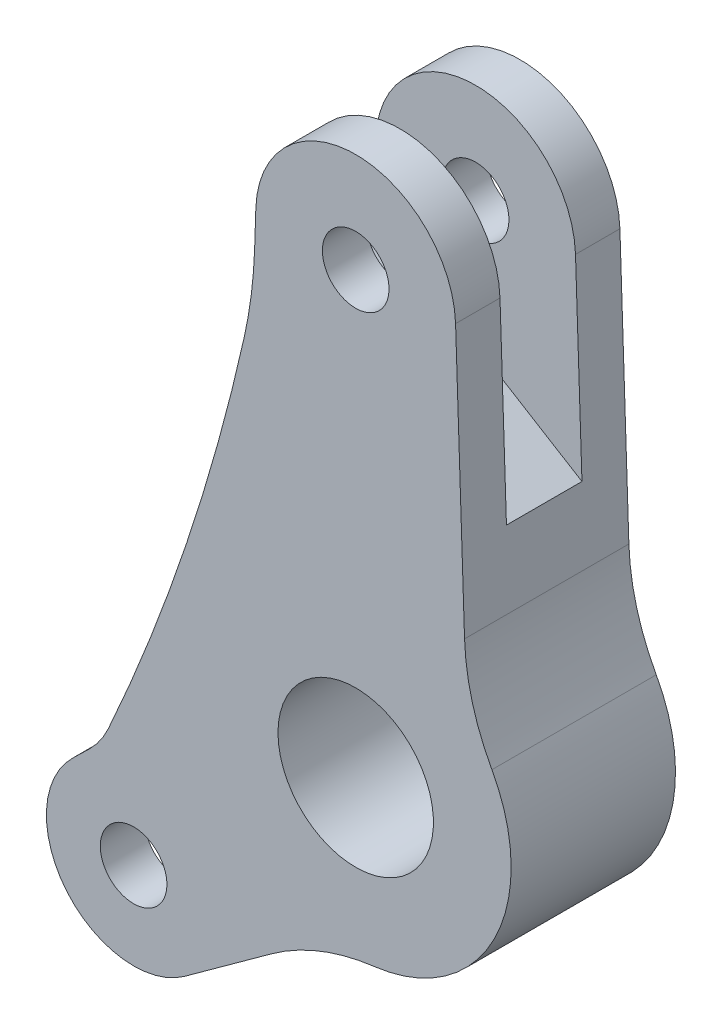
ISO-10303-21;
HEADER;
FILE_DESCRIPTION(('STEP AP214'),'2;1');
FILE_NAME('part.step','',(''),(''),'','','');
FILE_SCHEMA(('AUTOMOTIVE_DESIGN { 1 0 10303 214 1 1 1 1 }'));
ENDSEC;
DATA;
#1=APPLICATION_CONTEXT('core data for automotive mechanical design processes');
#2=APPLICATION_PROTOCOL_DEFINITION('international standard','automotive_design',2000,#1);
#3=PRODUCT_CONTEXT('',#1,'mechanical');
#4=PRODUCT('Part','Part','',(#3));
#5=PRODUCT_RELATED_PRODUCT_CATEGORY('part','',(#4));
#6=PRODUCT_DEFINITION_FORMATION('','',#4);
#7=PRODUCT_DEFINITION_CONTEXT('part definition',#1,'design');
#8=PRODUCT_DEFINITION('design','',#6,#7);
#9=PRODUCT_DEFINITION_SHAPE('','',#8);
#10=(LENGTH_UNIT() NAMED_UNIT(*) SI_UNIT(.MILLI.,.METRE.));
#11=(NAMED_UNIT(*) PLANE_ANGLE_UNIT() SI_UNIT($,.RADIAN.));
#12=(NAMED_UNIT(*) SI_UNIT($,.STERADIAN.) SOLID_ANGLE_UNIT());
#13=UNCERTAINTY_MEASURE_WITH_UNIT(LENGTH_MEASURE(1.E-05),#10,'distance_accuracy_value','');
#14=(GEOMETRIC_REPRESENTATION_CONTEXT(3) GLOBAL_UNCERTAINTY_ASSIGNED_CONTEXT((#13)) GLOBAL_UNIT_ASSIGNED_CONTEXT((#10,
#11,#12)) REPRESENTATION_CONTEXT('',''));
#15=CARTESIAN_POINT('',(0.,0.,0.));
#16=DIRECTION('',(0.,0.,1.));
#17=DIRECTION('',(1.,0.,0.));
#18=AXIS2_PLACEMENT_3D('',#15,#16,#17);
#19=CARTESIAN_POINT('',(-1.89883544819038,-4.38734354159406,1.85));
#20=DIRECTION('',(-0.586558009835035,0.809907217586288,0.));
#21=DIRECTION('',(0.809907217586288,0.586558009835035,0.));
#22=AXIS2_PLACEMENT_3D('',#19,#20,#21);
#23=PLANE('',#22);
#24=DIRECTION('',(-0.809907217586288,-0.586558009835035,0.));
#25=VECTOR('',#24,1.);
#26=CARTESIAN_POINT('',(-1.89883544819038,-4.38734354159406,-0.85));
#27=LINE('',#26,#25);
#28=CARTESIAN_POINT('',(-2.35712113183313,-4.7192471630169,-0.85));
#29=VERTEX_POINT('',#28);
#30=CARTESIAN_POINT('',(-3.84954684208149,-5.80010461856446,-0.85));
#31=VERTEX_POINT('',#30);
#32=EDGE_CURVE('E199',#29,#31,#27,.T.);
#33=ORIENTED_EDGE('',*,*,#32,.T.);
#34=DIRECTION('',(0.,0.,-1.));
#35=VECTOR('',#34,1.);
#36=CARTESIAN_POINT('',(-3.84954684208149,-5.80010461856446,1.85));
#37=LINE('',#36,#35);
#38=CARTESIAN_POINT('',(-3.84954684208149,-5.80010461856446,-1.85));
#39=VERTEX_POINT('',#38);
#40=EDGE_CURVE('E374',#31,#39,#37,.T.);
#41=ORIENTED_EDGE('',*,*,#40,.T.);
#42=DIRECTION('',(-0.809907217586288,-0.586558009835035,0.));
#43=VECTOR('',#42,1.);
#44=CARTESIAN_POINT('',(-1.89883544819038,-4.38734354159406,-1.85));
#45=LINE('',#44,#43);
#46=CARTESIAN_POINT('',(-1.89883544819038,-4.38734354159406,-1.85));
#47=VERTEX_POINT('',#46);
#48=EDGE_CURVE('E310',#47,#39,#45,.T.);
#49=ORIENTED_EDGE('',*,*,#48,.F.);
#50=DIRECTION('',(0.,0.,-1.));
#51=VECTOR('',#50,1.);
#52=CARTESIAN_POINT('',(-1.89883544819038,-4.38734354159406,1.85));
#53=LINE('',#52,#51);
#54=CARTESIAN_POINT('',(-1.89883544819038,-4.38734354159406,1.85));
#55=VERTEX_POINT('',#54);
#56=EDGE_CURVE('E11',#55,#47,#53,.T.);
#57=ORIENTED_EDGE('',*,*,#56,.F.);
#58=DIRECTION('',(-0.809907217586288,-0.586558009835035,0.));
#59=VECTOR('',#58,1.);
#60=CARTESIAN_POINT('',(-1.89883544819038,-4.38734354159406,1.85));
#61=LINE('',#60,#59);
#62=CARTESIAN_POINT('',(-3.84954684208149,-5.80010461856446,1.85));
#63=VERTEX_POINT('',#62);
#64=EDGE_CURVE('E276',#55,#63,#61,.T.);
#65=ORIENTED_EDGE('',*,*,#64,.T.);
#66=CARTESIAN_POINT('',(-3.84954684208149,-5.80010461856446,0.85));
#67=VERTEX_POINT('',#66);
#68=EDGE_CURVE('E44',#63,#67,#37,.T.);
#69=ORIENTED_EDGE('',*,*,#68,.T.);
#70=DIRECTION('',(-0.809907217586288,-0.586558009835035,0.));
#71=VECTOR('',#70,1.);
#72=CARTESIAN_POINT('',(-1.89883544819038,-4.38734354159406,0.85));
#73=LINE('',#72,#71);
#74=CARTESIAN_POINT('',(-2.35712113183313,-4.7192471630169,0.85));
#75=VERTEX_POINT('',#74);
#76=EDGE_CURVE('E219',#75,#67,#73,.T.);
#77=ORIENTED_EDGE('',*,*,#76,.F.);
#78=DIRECTION('',(0.,0.,1.));
#79=VECTOR('',#78,1.);
#80=CARTESIAN_POINT('',(-2.35712113183313,-4.7192471630169,1.85));
#81=LINE('',#80,#79);
#82=EDGE_CURVE('E253',#29,#75,#81,.T.);
#83=ORIENTED_EDGE('',*,*,#82,.F.);
#84=EDGE_LOOP('',(#33,#41,#49,#57,#65,#69,#77,#83));
#85=FACE_BOUND('',#84,.T.);
#86=ADVANCED_FACE('F35',(#85),#23,.F.);
#87=CARTESIAN_POINT('',(-5.00079103651948,-4.21049034913888,1.85));
#88=DIRECTION('',(0.,0.,-1.));
#89=DIRECTION('',(1.,0.,0.));
#90=AXIS2_PLACEMENT_3D('',#87,#88,#89);
#91=CYLINDRICAL_SURFACE('',#90,1.96271157350961);
#92=CARTESIAN_POINT('',(-5.00079103651948,-4.21049034913888,-0.85));
#93=DIRECTION('',(0.,0.,-1.));
#94=DIRECTION('',(-1.,0.,0.));
#95=AXIS2_PLACEMENT_3D('',#92,#93,#94);
#96=CIRCLE('',#95,1.96271157350961);
#97=CARTESIAN_POINT('',(-6.37107044623599,-2.80529603513973,-0.85));
#98=VERTEX_POINT('',#97);
#99=EDGE_CURVE('E226',#31,#98,#96,.T.);
#100=ORIENTED_EDGE('',*,*,#99,.T.);
#101=DIRECTION('',(0.,0.,-1.));
#102=VECTOR('',#101,1.);
#103=CARTESIAN_POINT('',(-6.37107044623599,-2.80529603513973,1.85));
#104=LINE('',#103,#102);
#105=CARTESIAN_POINT('',(-6.37107044623599,-2.80529603513973,-1.85));
#106=VERTEX_POINT('',#105);
#107=EDGE_CURVE('E370',#98,#106,#104,.T.);
#108=ORIENTED_EDGE('',*,*,#107,.T.);
#109=CARTESIAN_POINT('',(-5.00079103651948,-4.21049034913888,-1.85));
#110=DIRECTION('',(0.,0.,-1.));
#111=DIRECTION('',(-1.,0.,0.));
#112=AXIS2_PLACEMENT_3D('',#109,#110,#111);
#113=CIRCLE('',#112,1.96271157350961);
#114=EDGE_CURVE('E313',#39,#106,#113,.T.);
#115=ORIENTED_EDGE('',*,*,#114,.F.);
#116=ORIENTED_EDGE('',*,*,#40,.F.);
#117=EDGE_LOOP('',(#100,#108,#115,#116));
#118=FACE_BOUND('',#117,.T.);
#119=ADVANCED_FACE('F462',(#118),#91,.T.);
#120=CARTESIAN_POINT('',(-5.99474337438653,-2.43831957306836,1.85));
#121=DIRECTION('',(0.698156279410047,-0.715945395627572,0.));
#122=DIRECTION('',(-0.715945395627572,-0.698156279410047,0.));
#123=AXIS2_PLACEMENT_3D('',#120,#121,#122);
#124=PLANE('',#123);
#125=DIRECTION('',(0.715945395627572,0.698156279410047,0.));
#126=VECTOR('',#125,1.);
#127=CARTESIAN_POINT('',(-5.99474337438653,-2.43831957306836,-0.85));
#128=LINE('',#127,#126);
#129=CARTESIAN_POINT('',(-5.99474337438653,-2.43831957306836,-0.85));
#130=VERTEX_POINT('',#129);
#131=EDGE_CURVE('E216',#98,#130,#128,.T.);
#132=ORIENTED_EDGE('',*,*,#131,.T.);
#133=DIRECTION('',(0.,0.,-1.));
#134=VECTOR('',#133,1.);
#135=CARTESIAN_POINT('',(-5.99474337438653,-2.43831957306836,1.85));
#136=LINE('',#135,#134);
#137=CARTESIAN_POINT('',(-5.99474337438653,-2.43831957306836,-1.85));
#138=VERTEX_POINT('',#137);
#139=EDGE_CURVE('E366',#130,#138,#136,.T.);
#140=ORIENTED_EDGE('',*,*,#139,.T.);
#141=DIRECTION('',(0.715945395627572,0.698156279410047,0.));
#142=VECTOR('',#141,1.);
#143=CARTESIAN_POINT('',(-5.99474337438653,-2.43831957306836,-1.85));
#144=LINE('',#143,#142);
#145=EDGE_CURVE('E316',#106,#138,#144,.T.);
#146=ORIENTED_EDGE('',*,*,#145,.F.);
#147=ORIENTED_EDGE('',*,*,#107,.F.);
#148=EDGE_LOOP('',(#132,#140,#146,#147));
#149=FACE_BOUND('',#148,.T.);
#150=ADVANCED_FACE('F460',(#149),#124,.F.);
#151=CARTESIAN_POINT('',(-7.39105593320663,-1.00642878181321,1.85));
#152=DIRECTION('',(0.,0.,-1.));
#153=DIRECTION('',(1.,0.,0.));
#154=AXIS2_PLACEMENT_3D('',#151,#152,#153);
#155=CYLINDRICAL_SURFACE('',#154,2.);
#156=CARTESIAN_POINT('',(-7.39105593320663,-1.00642878181321,-0.85));
#157=DIRECTION('',(0.,0.,-1.));
#158=DIRECTION('',(-1.,0.,0.));
#159=AXIS2_PLACEMENT_3D('',#156,#157,#158);
#160=CIRCLE('',#159,2.);
#161=CARTESIAN_POINT('',(-5.56845578497481,-1.82991448276097,-0.85));
#162=VERTEX_POINT('',#161);
#163=EDGE_CURVE('E213',#130,#162,#160,.F.);
#164=ORIENTED_EDGE('',*,*,#163,.T.);
#165=DIRECTION('',(0.,0.,-1.));
#166=VECTOR('',#165,1.);
#167=CARTESIAN_POINT('',(-5.56845578497481,-1.82991448276097,1.85));
#168=LINE('',#167,#166);
#169=CARTESIAN_POINT('',(-5.56845578497481,-1.82991448276097,-1.85));
#170=VERTEX_POINT('',#169);
#171=EDGE_CURVE('E211',#162,#170,#168,.T.);
#172=ORIENTED_EDGE('',*,*,#171,.T.);
#173=CARTESIAN_POINT('',(-7.39105593320663,-1.00642878181321,-1.85));
#174=DIRECTION('',(0.,0.,1.));
#175=DIRECTION('',(-1.,0.,0.));
#176=AXIS2_PLACEMENT_3D('',#173,#174,#175);
#177=CIRCLE('',#176,2.);
#178=EDGE_CURVE('E319',#138,#170,#177,.T.);
#179=ORIENTED_EDGE('',*,*,#178,.F.);
#180=ORIENTED_EDGE('',*,*,#139,.F.);
#181=EDGE_LOOP('',(#164,#172,#179,#180));
#182=FACE_BOUND('',#181,.T.);
#183=ADVANCED_FACE('F455',(#182),#155,.F.);
#184=CARTESIAN_POINT('',(-48.7361620669657,17.67408308929,1.85));
#185=DIRECTION('',(0.,0.,-1.));
#186=DIRECTION('',(1.,0.,0.));
#187=AXIS2_PLACEMENT_3D('',#184,#185,#186);
#188=CYLINDRICAL_SURFACE('',#187,47.3693654901436);
#189=CARTESIAN_POINT('',(-48.7361620669657,17.67408308929,-0.85));
#190=DIRECTION('',(0.,0.,-1.));
#191=DIRECTION('',(-1.,0.,0.));
#192=AXIS2_PLACEMENT_3D('',#189,#190,#191);
#193=CIRCLE('',#192,47.3693654901436);
#194=CARTESIAN_POINT('',(-4.17602011367658,1.60390773114507,-0.85));
#195=VERTEX_POINT('',#194);
#196=EDGE_CURVE('E196',#162,#195,#193,.F.);
#197=ORIENTED_EDGE('',*,*,#196,.T.);
#198=DIRECTION('',(0.,0.,1.));
#199=VECTOR('',#198,1.);
#200=CARTESIAN_POINT('',(-4.17602011367658,1.60390773114507,-0.85));
#201=LINE('',#200,#199);
#202=CARTESIAN_POINT('',(-4.17602011367658,1.60390773114507,0.85));
#203=VERTEX_POINT('',#202);
#204=EDGE_CURVE('E201',#195,#203,#201,.T.);
#205=ORIENTED_EDGE('',*,*,#204,.T.);
#206=CARTESIAN_POINT('',(-48.7361620669657,17.67408308929,0.85));
#207=DIRECTION('',(0.,0.,-1.));
#208=DIRECTION('',(-1.,0.,0.));
#209=AXIS2_PLACEMENT_3D('',#206,#207,#208);
#210=CIRCLE('',#209,47.3693654901436);
#211=CARTESIAN_POINT('',(-5.56845578497481,-1.82991448276097,0.85));
#212=VERTEX_POINT('',#211);
#213=EDGE_CURVE('E378',#212,#203,#210,.F.);
#214=ORIENTED_EDGE('',*,*,#213,.F.);
#215=CARTESIAN_POINT('',(-5.56845578497481,-1.82991448276097,1.85));
#216=VERTEX_POINT('',#215);
#217=EDGE_CURVE('E363',#216,#212,#168,.T.);
#218=ORIENTED_EDGE('',*,*,#217,.F.);
#219=CARTESIAN_POINT('',(-48.7361620669657,17.67408308929,1.85));
#220=DIRECTION('',(0.,0.,1.));
#221=DIRECTION('',(-1.,0.,0.));
#222=AXIS2_PLACEMENT_3D('',#219,#220,#221);
#223=CIRCLE('',#222,47.3693654901436);
#224=CARTESIAN_POINT('',(-2.51157735789529,7.32301766524892,1.85));
#225=VERTEX_POINT('',#224);
#226=EDGE_CURVE('E288',#216,#225,#223,.T.);
#227=ORIENTED_EDGE('',*,*,#226,.T.);
#228=DIRECTION('',(0.,0.,-1.));
#229=VECTOR('',#228,1.);
#230=CARTESIAN_POINT('',(-2.51157735789529,7.32301766524892,1.85));
#231=LINE('',#230,#229);
#232=CARTESIAN_POINT('',(-2.51157735789529,7.32301766524892,-1.85));
#233=VERTEX_POINT('',#232);
#234=EDGE_CURVE('E360',#225,#233,#231,.T.);
#235=ORIENTED_EDGE('',*,*,#234,.T.);
#236=CARTESIAN_POINT('',(-48.7361620669657,17.67408308929,-1.85));
#237=DIRECTION('',(0.,0.,1.));
#238=DIRECTION('',(-1.,0.,0.));
#239=AXIS2_PLACEMENT_3D('',#236,#237,#238);
#240=CIRCLE('',#239,47.3693654901436);
#241=EDGE_CURVE('E322',#170,#233,#240,.T.);
#242=ORIENTED_EDGE('',*,*,#241,.F.);
#243=ORIENTED_EDGE('',*,*,#171,.F.);
#244=EDGE_LOOP('',(#197,#205,#214,#218,#227,#235,#242,#243));
#245=FACE_BOUND('',#244,.T.);
#246=ADVANCED_FACE('F209',(#245),#188,.F.);
#247=CARTESIAN_POINT('',(-12.2699062336934,9.50819901968249,1.85));
#248=DIRECTION('',(0.,0.,-1.));
#249=DIRECTION('',(1.,0.,0.));
#250=AXIS2_PLACEMENT_3D('',#247,#248,#249);
#251=CYLINDRICAL_SURFACE('',#250,10.);
#252=CARTESIAN_POINT('',(-12.2699062336934,9.50819901968249,-0.85));
#253=DIRECTION('',(0.,0.,-1.));
#254=DIRECTION('',(-1.,0.,0.));
#255=AXIS2_PLACEMENT_3D('',#252,#253,#254);
#256=CIRCLE('',#255,10.);
#257=CARTESIAN_POINT('',(-2.32019862464675,8.50654114671467,-0.85));
#258=VERTEX_POINT('',#257);
#259=CARTESIAN_POINT('',(-2.27547486616742,9.17452007247119,-0.85));
#260=VERTEX_POINT('',#259);
#261=EDGE_CURVE('E250',#258,#260,#256,.F.);
#262=ORIENTED_EDGE('',*,*,#261,.T.);
#263=DIRECTION('',(0.,0.,-1.));
#264=VECTOR('',#263,1.);
#265=CARTESIAN_POINT('',(-2.27547486616742,9.17452007247119,1.85));
#266=LINE('',#265,#264);
#267=CARTESIAN_POINT('',(-2.27547486616742,9.17452007247119,-1.85));
#268=VERTEX_POINT('',#267);
#269=EDGE_CURVE('E356',#260,#268,#266,.T.);
#270=ORIENTED_EDGE('',*,*,#269,.T.);
#271=CARTESIAN_POINT('',(-12.2699062336934,9.50819901968249,-1.85));
#272=DIRECTION('',(0.,0.,1.));
#273=DIRECTION('',(1.,0.,0.));
#274=AXIS2_PLACEMENT_3D('',#271,#272,#273);
#275=CIRCLE('',#274,10.);
#276=EDGE_CURVE('E325',#233,#268,#275,.T.);
#277=ORIENTED_EDGE('',*,*,#276,.F.);
#278=ORIENTED_EDGE('',*,*,#234,.F.);
#279=CARTESIAN_POINT('',(-12.2699062336934,9.50819901968249,1.85));
#280=DIRECTION('',(0.,0.,1.));
#281=DIRECTION('',(1.,0.,0.));
#282=AXIS2_PLACEMENT_3D('',#279,#280,#281);
#283=CIRCLE('',#282,10.);
#284=CARTESIAN_POINT('',(-2.27547486616742,9.17452007247119,1.85));
#285=VERTEX_POINT('',#284);
#286=EDGE_CURVE('E291',#225,#285,#283,.T.);
#287=ORIENTED_EDGE('',*,*,#286,.T.);
#288=CARTESIAN_POINT('',(-2.27547486616742,9.17452007247119,0.85));
#289=VERTEX_POINT('',#288);
#290=EDGE_CURVE('E357',#285,#289,#266,.T.);
#291=ORIENTED_EDGE('',*,*,#290,.T.);
#292=CARTESIAN_POINT('',(-12.2699062336934,9.50819901968249,0.85));
#293=DIRECTION('',(0.,0.,-1.));
#294=DIRECTION('',(-1.,0.,0.));
#295=AXIS2_PLACEMENT_3D('',#292,#293,#294);
#296=CIRCLE('',#295,10.);
#297=CARTESIAN_POINT('',(-2.32019862464675,8.50654114671467,0.85));
#298=VERTEX_POINT('',#297);
#299=EDGE_CURVE('E238',#298,#289,#296,.F.);
#300=ORIENTED_EDGE('',*,*,#299,.F.);
#301=DIRECTION('',(0.,0.,1.));
#302=VECTOR('',#301,1.);
#303=CARTESIAN_POINT('',(-2.32019862464675,8.50654114671467,-0.85));
#304=LINE('',#303,#302);
#305=EDGE_CURVE('E397',#258,#298,#304,.T.);
#306=ORIENTED_EDGE('',*,*,#305,.F.);
#307=EDGE_LOOP('',(#262,#270,#277,#278,#287,#291,#300,#306));
#308=FACE_BOUND('',#307,.T.);
#309=ADVANCED_FACE('F402',(#308),#251,.F.);
#310=CARTESIAN_POINT('',(-2.24874705769335,9.97507776312254,1.85));
#311=DIRECTION('',(0.999443136752602,-0.033367894721129,0.));
#312=DIRECTION('',(-0.033367894721129,-0.999443136752602,0.));
#313=AXIS2_PLACEMENT_3D('',#310,#311,#312);
#314=PLANE('',#313);
#315=DIRECTION('',(0.033367894721129,0.999443136752602,0.));
#316=VECTOR('',#315,1.);
#317=CARTESIAN_POINT('',(-2.24874705769335,9.97507776312254,-0.85));
#318=LINE('',#317,#316);
#319=CARTESIAN_POINT('',(-2.24874705769335,9.97507776312254,-0.85));
#320=VERTEX_POINT('',#319);
#321=EDGE_CURVE('E247',#260,#320,#318,.T.);
#322=ORIENTED_EDGE('',*,*,#321,.T.);
#323=DIRECTION('',(0.,0.,-1.));
#324=VECTOR('',#323,1.);
#325=CARTESIAN_POINT('',(-2.24874705769335,9.97507776312254,1.85));
#326=LINE('',#325,#324);
#327=CARTESIAN_POINT('',(-2.24874705769335,9.97507776312254,-1.85));
#328=VERTEX_POINT('',#327);
#329=EDGE_CURVE('E352',#320,#328,#326,.T.);
#330=ORIENTED_EDGE('',*,*,#329,.T.);
#331=DIRECTION('',(0.033367894721129,0.999443136752602,0.));
#332=VECTOR('',#331,1.);
#333=CARTESIAN_POINT('',(-2.24874705769335,9.97507776312254,-1.85));
#334=LINE('',#333,#332);
#335=EDGE_CURVE('E328',#268,#328,#334,.T.);
#336=ORIENTED_EDGE('',*,*,#335,.F.);
#337=ORIENTED_EDGE('',*,*,#269,.F.);
#338=EDGE_LOOP('',(#322,#330,#336,#337));
#339=FACE_BOUND('',#338,.T.);
#340=ADVANCED_FACE('F481',(#339),#314,.F.);
#341=CARTESIAN_POINT('',(0.,9.9,1.85));
#342=DIRECTION('',(0.,0.,-1.));
#343=DIRECTION('',(1.,0.,0.));
#344=AXIS2_PLACEMENT_3D('',#341,#342,#343);
#345=CYLINDRICAL_SURFACE('',#344,2.25);
#346=CARTESIAN_POINT('',(0.,9.9,-0.85));
#347=DIRECTION('',(0.,0.,-1.));
#348=DIRECTION('',(-1.,0.,0.));
#349=AXIS2_PLACEMENT_3D('',#346,#347,#348);
#350=CIRCLE('',#349,2.25);
#351=CARTESIAN_POINT('',(2.24874705769335,9.97507776312254,-0.85));
#352=VERTEX_POINT('',#351);
#353=EDGE_CURVE('E244',#320,#352,#350,.T.);
#354=ORIENTED_EDGE('',*,*,#353,.T.);
#355=DIRECTION('',(0.,0.,-1.));
#356=VECTOR('',#355,1.);
#357=CARTESIAN_POINT('',(2.24874705769335,9.97507776312254,1.85));
#358=LINE('',#357,#356);
#359=CARTESIAN_POINT('',(2.24874705769335,9.97507776312254,-1.85));
#360=VERTEX_POINT('',#359);
#361=EDGE_CURVE('E348',#352,#360,#358,.T.);
#362=ORIENTED_EDGE('',*,*,#361,.T.);
#363=CARTESIAN_POINT('',(0.,9.9,-1.85));
#364=DIRECTION('',(0.,0.,-1.));
#365=DIRECTION('',(1.,0.,0.));
#366=AXIS2_PLACEMENT_3D('',#363,#364,#365);
#367=CIRCLE('',#366,2.25);
#368=EDGE_CURVE('E331',#328,#360,#367,.T.);
#369=ORIENTED_EDGE('',*,*,#368,.F.);
#370=ORIENTED_EDGE('',*,*,#329,.F.);
#371=EDGE_LOOP('',(#354,#362,#369,#370));
#372=FACE_BOUND('',#371,.T.);
#373=ADVANCED_FACE('F478',(#372),#345,.T.);
#374=CARTESIAN_POINT('',(2.24874705769335,9.97507776312254,1.85));
#375=DIRECTION('',(-0.999443136752602,-0.0333678947211292,0.));
#376=DIRECTION('',(-0.0333678947211292,0.999443136752602,0.));
#377=AXIS2_PLACEMENT_3D('',#374,#375,#376);
#378=PLANE('',#377);
#379=DIRECTION('',(0.0333678947211292,-0.999443136752602,0.));
#380=VECTOR('',#379,1.);
#381=CARTESIAN_POINT('',(2.24874705769335,9.97507776312254,-0.85));
#382=LINE('',#381,#380);
#383=CARTESIAN_POINT('',(2.39415597007872,5.61975535753527,-0.85));
#384=VERTEX_POINT('',#383);
#385=EDGE_CURVE('E241',#352,#384,#382,.T.);
#386=ORIENTED_EDGE('',*,*,#385,.T.);
#387=DIRECTION('',(0.,0.,1.));
#388=VECTOR('',#387,1.);
#389=CARTESIAN_POINT('',(2.39415597007872,5.61975535753527,-0.85));
#390=LINE('',#389,#388);
#391=CARTESIAN_POINT('',(2.39415597007872,5.61975535753527,0.85));
#392=VERTEX_POINT('',#391);
#393=EDGE_CURVE('E400',#384,#392,#390,.T.);
#394=ORIENTED_EDGE('',*,*,#393,.T.);
#395=DIRECTION('',(0.0333678947211292,-0.999443136752602,0.));
#396=VECTOR('',#395,1.);
#397=CARTESIAN_POINT('',(2.24874705769335,9.97507776312254,0.85));
#398=LINE('',#397,#396);
#399=CARTESIAN_POINT('',(2.24874705769335,9.97507776312254,0.85));
#400=VERTEX_POINT('',#399);
#401=EDGE_CURVE('E231',#400,#392,#398,.T.);
#402=ORIENTED_EDGE('',*,*,#401,.F.);
#403=CARTESIAN_POINT('',(2.24874705769335,9.97507776312254,1.85));
#404=VERTEX_POINT('',#403);
#405=EDGE_CURVE('E349',#404,#400,#358,.T.);
#406=ORIENTED_EDGE('',*,*,#405,.F.);
#407=DIRECTION('',(0.0333678947211292,-0.999443136752602,0.));
#408=VECTOR('',#407,1.);
#409=CARTESIAN_POINT('',(2.24874705769335,9.97507776312254,1.85));
#410=LINE('',#409,#408);
#411=CARTESIAN_POINT('',(2.45058666713269,3.92952966771848,1.85));
#412=VERTEX_POINT('',#411);
#413=EDGE_CURVE('E299',#404,#412,#410,.T.);
#414=ORIENTED_EDGE('',*,*,#413,.T.);
#415=DIRECTION('',(0.,0.,-1.));
#416=VECTOR('',#415,1.);
#417=CARTESIAN_POINT('',(2.45058666713269,3.92952966771848,1.85));
#418=LINE('',#417,#416);
#419=CARTESIAN_POINT('',(2.45058666713269,3.92952966771848,-1.85));
#420=VERTEX_POINT('',#419);
#421=EDGE_CURVE('E345',#412,#420,#418,.T.);
#422=ORIENTED_EDGE('',*,*,#421,.T.);
#423=DIRECTION('',(0.0333678947211292,-0.999443136752602,0.));
#424=VECTOR('',#423,1.);
#425=CARTESIAN_POINT('',(2.24874705769335,9.97507776312254,-1.85));
#426=LINE('',#425,#424);
#427=EDGE_CURVE('E334',#360,#420,#426,.T.);
#428=ORIENTED_EDGE('',*,*,#427,.F.);
#429=ORIENTED_EDGE('',*,*,#361,.F.);
#430=EDGE_LOOP('',(#386,#394,#402,#406,#414,#422,#428,#429));
#431=FACE_BOUND('',#430,.T.);
#432=ADVANCED_FACE('F413',(#431),#378,.F.);
#433=CARTESIAN_POINT('',(0.,9.9,1.85));
#434=DIRECTION('',(0.,0.,-1.));
#435=DIRECTION('',(1.,0.,0.));
#436=AXIS2_PLACEMENT_3D('',#433,#434,#435);
#437=CYLINDRICAL_SURFACE('',#436,0.749999999999999);
#438=CARTESIAN_POINT('',(0.,9.9,-1.85));
#439=DIRECTION('',(0.,0.,-1.));
#440=DIRECTION('',(-1.,0.,0.));
#441=AXIS2_PLACEMENT_3D('',#438,#439,#440);
#442=CIRCLE('',#441,0.749999999999999);
#443=CARTESIAN_POINT('',(-0.749999999999999,9.9,-1.85));
#444=VERTEX_POINT('',#443);
#445=EDGE_CURVE('E259',#444,#444,#442,.T.);
#446=ORIENTED_EDGE('',*,*,#445,.T.);
#447=EDGE_LOOP('',(#446));
#448=FACE_BOUND('',#447,.T.);
#449=CARTESIAN_POINT('',(0.,9.9,-0.85));
#450=DIRECTION('',(0.,0.,-1.));
#451=DIRECTION('',(-1.,0.,0.));
#452=AXIS2_PLACEMENT_3D('',#449,#450,#451);
#453=CIRCLE('',#452,0.749999999999999);
#454=CARTESIAN_POINT('',(-0.749999999999999,9.9,-0.85));
#455=VERTEX_POINT('',#454);
#456=EDGE_CURVE('E39',#455,#455,#453,.T.);
#457=ORIENTED_EDGE('',*,*,#456,.F.);
#458=EDGE_LOOP('',(#457));
#459=FACE_BOUND('',#458,.T.);
#460=ADVANCED_FACE('F553',(#448,#459),#437,.F.);
#461=CARTESIAN_POINT('',(-5.00079103651948,-4.21049034913888,1.85));
#462=DIRECTION('',(0.,0.,-1.));
#463=DIRECTION('',(1.,0.,0.));
#464=AXIS2_PLACEMENT_3D('',#461,#462,#463);
#465=CYLINDRICAL_SURFACE('',#464,0.749999999999998);
#466=CARTESIAN_POINT('',(-5.00079103651948,-4.21049034913888,-1.85));
#467=DIRECTION('',(0.,0.,-1.));
#468=DIRECTION('',(-1.,0.,0.));
#469=AXIS2_PLACEMENT_3D('',#466,#467,#468);
#470=CIRCLE('',#469,0.749999999999998);
#471=CARTESIAN_POINT('',(-5.75079103651948,-4.21049034913888,-1.85));
#472=VERTEX_POINT('',#471);
#473=EDGE_CURVE('E255',#472,#472,#470,.T.);
#474=ORIENTED_EDGE('',*,*,#473,.T.);
#475=EDGE_LOOP('',(#474));
#476=FACE_BOUND('',#475,.T.);
#477=CARTESIAN_POINT('',(-5.00079103651948,-4.21049034913888,-0.85));
#478=DIRECTION('',(0.,0.,-1.));
#479=DIRECTION('',(-1.,0.,0.));
#480=AXIS2_PLACEMENT_3D('',#477,#478,#479);
#481=CIRCLE('',#480,0.749999999999998);
#482=CARTESIAN_POINT('',(-5.75079103651948,-4.21049034913888,-0.85));
#483=VERTEX_POINT('',#482);
#484=EDGE_CURVE('E214',#483,#483,#481,.T.);
#485=ORIENTED_EDGE('',*,*,#484,.F.);
#486=EDGE_LOOP('',(#485));
#487=FACE_BOUND('',#486,.T.);
#488=ADVANCED_FACE('F561',(#476,#487),#465,.F.);
#489=CARTESIAN_POINT('',(1.0339546009848,-8.4368796295255,1.85));
#490=DIRECTION('',(0.,0.,-1.));
#491=DIRECTION('',(1.,0.,0.));
#492=AXIS2_PLACEMENT_3D('',#489,#490,#491);
#493=PLANE('',#492);
#494=CARTESIAN_POINT('',(1.0339546009848,-8.4368796295255,1.85));
#495=DIRECTION('',(0.,0.,1.));
#496=DIRECTION('',(1.,0.,0.));
#497=AXIS2_PLACEMENT_3D('',#494,#495,#496);
#498=CIRCLE('',#497,5.);
#499=CARTESIAN_POINT('',(0.425746012170211,-3.47400925921638,1.85));
#500=VERTEX_POINT('',#499);
#501=EDGE_CURVE('E274',#500,#55,#498,.T.);
#502=ORIENTED_EDGE('',*,*,#501,.F.);
#503=CARTESIAN_POINT('',(0.,0.,1.85));
#504=DIRECTION('',(0.,0.,-1.));
#505=DIRECTION('',(-1.,0.,0.));
#506=AXIS2_PLACEMENT_3D('',#503,#504,#505);
#507=CIRCLE('',#506,3.5);
#508=CARTESIAN_POINT('',(3.06674214448646,1.68674023466288,1.85));
#509=VERTEX_POINT('',#508);
#510=EDGE_CURVE('E305',#509,#500,#507,.T.);
#511=ORIENTED_EDGE('',*,*,#510,.F.);
#512=CARTESIAN_POINT('',(7.44780235089569,4.09636914132413,1.85));
#513=DIRECTION('',(0.,0.,1.));
#514=DIRECTION('',(1.,0.,0.));
#515=AXIS2_PLACEMENT_3D('',#512,#513,#514);
#516=CIRCLE('',#515,5.);
#517=EDGE_CURVE('E302',#412,#509,#516,.T.);
#518=ORIENTED_EDGE('',*,*,#517,.F.);
#519=ORIENTED_EDGE('',*,*,#413,.F.);
#520=CARTESIAN_POINT('',(0.,9.9,1.85));
#521=DIRECTION('',(0.,0.,-1.));
#522=DIRECTION('',(1.,0.,0.));
#523=AXIS2_PLACEMENT_3D('',#520,#521,#522);
#524=CIRCLE('',#523,2.25);
#525=CARTESIAN_POINT('',(-2.24874705769335,9.97507776312254,1.85));
#526=VERTEX_POINT('',#525);
#527=EDGE_CURVE('E297',#526,#404,#524,.T.);
#528=ORIENTED_EDGE('',*,*,#527,.F.);
#529=DIRECTION('',(0.033367894721129,0.999443136752602,0.));
#530=VECTOR('',#529,1.);
#531=CARTESIAN_POINT('',(-2.24874705769335,9.97507776312254,1.85));
#532=LINE('',#531,#530);
#533=EDGE_CURVE('E294',#285,#526,#532,.T.);
#534=ORIENTED_EDGE('',*,*,#533,.F.);
#535=ORIENTED_EDGE('',*,*,#286,.F.);
#536=ORIENTED_EDGE('',*,*,#226,.F.);
#537=CARTESIAN_POINT('',(-7.39105593320663,-1.00642878181321,1.85));
#538=DIRECTION('',(0.,0.,1.));
#539=DIRECTION('',(-1.,0.,0.));
#540=AXIS2_PLACEMENT_3D('',#537,#538,#539);
#541=CIRCLE('',#540,2.);
#542=CARTESIAN_POINT('',(-5.99474337438653,-2.43831957306836,1.85));
#543=VERTEX_POINT('',#542);
#544=EDGE_CURVE('E286',#543,#216,#541,.T.);
#545=ORIENTED_EDGE('',*,*,#544,.F.);
#546=DIRECTION('',(0.715945395627572,0.698156279410047,0.));
#547=VECTOR('',#546,1.);
#548=CARTESIAN_POINT('',(-5.99474337438653,-2.43831957306836,1.85));
#549=LINE('',#548,#547);
#550=CARTESIAN_POINT('',(-6.37107044623599,-2.80529603513973,1.85));
#551=VERTEX_POINT('',#550);
#552=EDGE_CURVE('E283',#551,#543,#549,.T.);
#553=ORIENTED_EDGE('',*,*,#552,.F.);
#554=CARTESIAN_POINT('',(-5.00079103651948,-4.21049034913888,1.85));
#555=DIRECTION('',(0.,0.,-1.));
#556=DIRECTION('',(-1.,0.,0.));
#557=AXIS2_PLACEMENT_3D('',#554,#555,#556);
#558=CIRCLE('',#557,1.96271157350961);
#559=EDGE_CURVE('E280',#63,#551,#558,.T.);
#560=ORIENTED_EDGE('',*,*,#559,.F.);
#561=ORIENTED_EDGE('',*,*,#64,.F.);
#562=EDGE_LOOP('',(#502,#511,#518,#519,#528,#534,#535,#536,#545,#553,#560,#561));
#563=FACE_BOUND('',#562,.T.);
#564=CARTESIAN_POINT('',(0.,0.,1.85));
#565=DIRECTION('',(0.,0.,-1.));
#566=DIRECTION('',(-1.,0.,0.));
#567=AXIS2_PLACEMENT_3D('',#564,#565,#566);
#568=CIRCLE('',#567,1.75);
#569=CARTESIAN_POINT('',(-1.75,0.,1.85));
#570=VERTEX_POINT('',#569);
#571=EDGE_CURVE('E268',#570,#570,#568,.T.);
#572=ORIENTED_EDGE('',*,*,#571,.T.);
#573=EDGE_LOOP('',(#572));
#574=FACE_BOUND('',#573,.T.);
#575=CARTESIAN_POINT('',(0.,9.9,1.85));
#576=DIRECTION('',(0.,0.,-1.));
#577=DIRECTION('',(-1.,0.,0.));
#578=AXIS2_PLACEMENT_3D('',#575,#576,#577);
#579=CIRCLE('',#578,0.749999999999999);
#580=CARTESIAN_POINT('',(-0.749999999999999,9.9,1.85));
#581=VERTEX_POINT('',#580);
#582=EDGE_CURVE('E262',#581,#581,#579,.T.);
#583=ORIENTED_EDGE('',*,*,#582,.T.);
#584=EDGE_LOOP('',(#583));
#585=FACE_BOUND('',#584,.T.);
#586=CARTESIAN_POINT('',(-5.00079103651948,-4.21049034913888,1.85));
#587=DIRECTION('',(0.,0.,-1.));
#588=DIRECTION('',(-1.,0.,0.));
#589=AXIS2_PLACEMENT_3D('',#586,#587,#588);
#590=CIRCLE('',#589,0.749999999999998);
#591=CARTESIAN_POINT('',(-5.75079103651948,-4.21049034913888,1.85));
#592=VERTEX_POINT('',#591);
#593=EDGE_CURVE('E256',#592,#592,#590,.T.);
#594=ORIENTED_EDGE('',*,*,#593,.T.);
#595=EDGE_LOOP('',(#594));
#596=FACE_BOUND('',#595,.T.);
#597=ADVANCED_FACE('F445',(#563,#574,#585,#596),#493,.F.);
#598=CARTESIAN_POINT('',(1.0339546009848,-8.4368796295255,-1.85));
#599=DIRECTION('',(0.,0.,-1.));
#600=DIRECTION('',(1.,0.,0.));
#601=AXIS2_PLACEMENT_3D('',#598,#599,#600);
#602=PLANE('',#601);
#603=ORIENTED_EDGE('',*,*,#445,.F.);
#604=EDGE_LOOP('',(#603));
#605=FACE_BOUND('',#604,.T.);
#606=CARTESIAN_POINT('',(1.0339546009848,-8.4368796295255,-1.85));
#607=DIRECTION('',(0.,0.,1.));
#608=DIRECTION('',(1.,0.,0.));
#609=AXIS2_PLACEMENT_3D('',#606,#607,#608);
#610=CIRCLE('',#609,5.);
#611=CARTESIAN_POINT('',(0.425746012170211,-3.47400925921638,-1.85));
#612=VERTEX_POINT('',#611);
#613=EDGE_CURVE('E271',#612,#47,#610,.T.);
#614=ORIENTED_EDGE('',*,*,#613,.T.);
#615=ORIENTED_EDGE('',*,*,#48,.T.);
#616=ORIENTED_EDGE('',*,*,#114,.T.);
#617=ORIENTED_EDGE('',*,*,#145,.T.);
#618=ORIENTED_EDGE('',*,*,#178,.T.);
#619=ORIENTED_EDGE('',*,*,#241,.T.);
#620=ORIENTED_EDGE('',*,*,#276,.T.);
#621=ORIENTED_EDGE('',*,*,#335,.T.);
#622=ORIENTED_EDGE('',*,*,#368,.T.);
#623=ORIENTED_EDGE('',*,*,#427,.T.);
#624=CARTESIAN_POINT('',(7.44780235089569,4.09636914132413,-1.85));
#625=DIRECTION('',(0.,0.,1.));
#626=DIRECTION('',(1.,0.,0.));
#627=AXIS2_PLACEMENT_3D('',#624,#625,#626);
#628=CIRCLE('',#627,5.);
#629=CARTESIAN_POINT('',(3.06674214448646,1.68674023466288,-1.85));
#630=VERTEX_POINT('',#629);
#631=EDGE_CURVE('E337',#420,#630,#628,.T.);
#632=ORIENTED_EDGE('',*,*,#631,.T.);
#633=CARTESIAN_POINT('',(0.,0.,-1.85));
#634=DIRECTION('',(0.,0.,-1.));
#635=DIRECTION('',(-1.,0.,0.));
#636=AXIS2_PLACEMENT_3D('',#633,#634,#635);
#637=CIRCLE('',#636,3.5);
#638=EDGE_CURVE('E277',#630,#612,#637,.T.);
#639=ORIENTED_EDGE('',*,*,#638,.T.);
#640=EDGE_LOOP('',(#614,#615,#616,#617,#618,#619,#620,#621,#622,#623,#632,#639));
#641=FACE_BOUND('',#640,.T.);
#642=CARTESIAN_POINT('',(0.,0.,-1.85));
#643=DIRECTION('',(0.,0.,-1.));
#644=DIRECTION('',(-1.,0.,0.));
#645=AXIS2_PLACEMENT_3D('',#642,#643,#644);
#646=CIRCLE('',#645,1.75);
#647=CARTESIAN_POINT('',(-1.75,0.,-1.85));
#648=VERTEX_POINT('',#647);
#649=EDGE_CURVE('E265',#648,#648,#646,.T.);
#650=ORIENTED_EDGE('',*,*,#649,.F.);
#651=EDGE_LOOP('',(#650));
#652=FACE_BOUND('',#651,.T.);
#653=ORIENTED_EDGE('',*,*,#473,.F.);
#654=EDGE_LOOP('',(#653));
#655=FACE_BOUND('',#654,.T.);
#656=ADVANCED_FACE('F450',(#605,#641,#652,#655),#602,.T.);
#657=CARTESIAN_POINT('',(1.0339546009848,-8.4368796295255,1.85));
#658=DIRECTION('',(0.,0.,-1.));
#659=DIRECTION('',(1.,0.,0.));
#660=AXIS2_PLACEMENT_3D('',#657,#658,#659);
#661=CYLINDRICAL_SURFACE('',#660,5.);
#662=ORIENTED_EDGE('',*,*,#613,.F.);
#663=DIRECTION('',(0.,0.,-1.));
#664=VECTOR('',#663,1.);
#665=CARTESIAN_POINT('',(0.425746012170211,-3.47400925921638,1.85));
#666=LINE('',#665,#664);
#667=EDGE_CURVE('E308',#500,#612,#666,.T.);
#668=ORIENTED_EDGE('',*,*,#667,.F.);
#669=ORIENTED_EDGE('',*,*,#501,.T.);
#670=ORIENTED_EDGE('',*,*,#56,.T.);
#671=EDGE_LOOP('',(#662,#668,#669,#670));
#672=FACE_BOUND('',#671,.T.);
#673=ADVANCED_FACE('F37',(#672),#661,.F.);
#674=ORIENTED_EDGE('',*,*,#68,.F.);
#675=ORIENTED_EDGE('',*,*,#559,.T.);
#676=CARTESIAN_POINT('',(-6.37107044623599,-2.80529603513973,0.85));
#677=VERTEX_POINT('',#676);
#678=EDGE_CURVE('E371',#551,#677,#104,.T.);
#679=ORIENTED_EDGE('',*,*,#678,.T.);
#680=CARTESIAN_POINT('',(-5.00079103651948,-4.21049034913888,0.85));
#681=DIRECTION('',(0.,0.,-1.));
#682=DIRECTION('',(-1.,0.,0.));
#683=AXIS2_PLACEMENT_3D('',#680,#681,#682);
#684=CIRCLE('',#683,1.96271157350961);
#685=EDGE_CURVE('E423',#67,#677,#684,.T.);
#686=ORIENTED_EDGE('',*,*,#685,.F.);
#687=EDGE_LOOP('',(#674,#675,#679,#686));
#688=FACE_BOUND('',#687,.T.);
#689=ADVANCED_FACE('F434',(#688),#91,.T.);
#690=ORIENTED_EDGE('',*,*,#678,.F.);
#691=ORIENTED_EDGE('',*,*,#552,.T.);
#692=CARTESIAN_POINT('',(-5.99474337438653,-2.43831957306836,0.85));
#693=VERTEX_POINT('',#692);
#694=EDGE_CURVE('E367',#543,#693,#136,.T.);
#695=ORIENTED_EDGE('',*,*,#694,.T.);
#696=DIRECTION('',(0.715945395627572,0.698156279410047,0.));
#697=VECTOR('',#696,1.);
#698=CARTESIAN_POINT('',(-5.99474337438653,-2.43831957306836,0.85));
#699=LINE('',#698,#697);
#700=EDGE_CURVE('E421',#677,#693,#699,.T.);
#701=ORIENTED_EDGE('',*,*,#700,.F.);
#702=EDGE_LOOP('',(#690,#691,#695,#701));
#703=FACE_BOUND('',#702,.T.);
#704=ADVANCED_FACE('F437',(#703),#124,.F.);
#705=ORIENTED_EDGE('',*,*,#694,.F.);
#706=ORIENTED_EDGE('',*,*,#544,.T.);
#707=ORIENTED_EDGE('',*,*,#217,.T.);
#708=CARTESIAN_POINT('',(-7.39105593320663,-1.00642878181321,0.85));
#709=DIRECTION('',(0.,0.,-1.));
#710=DIRECTION('',(-1.,0.,0.));
#711=AXIS2_PLACEMENT_3D('',#708,#709,#710);
#712=CIRCLE('',#711,2.);
#713=EDGE_CURVE('E419',#693,#212,#712,.F.);
#714=ORIENTED_EDGE('',*,*,#713,.F.);
#715=EDGE_LOOP('',(#705,#706,#707,#714));
#716=FACE_BOUND('',#715,.T.);
#717=ADVANCED_FACE('F441',(#716),#155,.F.);
#718=ORIENTED_EDGE('',*,*,#290,.F.);
#719=ORIENTED_EDGE('',*,*,#533,.T.);
#720=CARTESIAN_POINT('',(-2.24874705769335,9.97507776312254,0.85));
#721=VERTEX_POINT('',#720);
#722=EDGE_CURVE('E353',#526,#721,#326,.T.);
#723=ORIENTED_EDGE('',*,*,#722,.T.);
#724=DIRECTION('',(0.033367894721129,0.999443136752602,0.));
#725=VECTOR('',#724,1.);
#726=CARTESIAN_POINT('',(-2.24874705769335,9.97507776312254,0.85));
#727=LINE('',#726,#725);
#728=EDGE_CURVE('E235',#289,#721,#727,.T.);
#729=ORIENTED_EDGE('',*,*,#728,.F.);
#730=EDGE_LOOP('',(#718,#719,#723,#729));
#731=FACE_BOUND('',#730,.T.);
#732=ADVANCED_FACE('F406',(#731),#314,.F.);
#733=ORIENTED_EDGE('',*,*,#722,.F.);
#734=ORIENTED_EDGE('',*,*,#527,.T.);
#735=ORIENTED_EDGE('',*,*,#405,.T.);
#736=CARTESIAN_POINT('',(0.,9.9,0.85));
#737=DIRECTION('',(0.,0.,-1.));
#738=DIRECTION('',(-1.,0.,0.));
#739=AXIS2_PLACEMENT_3D('',#736,#737,#738);
#740=CIRCLE('',#739,2.25);
#741=EDGE_CURVE('E233',#721,#400,#740,.T.);
#742=ORIENTED_EDGE('',*,*,#741,.F.);
#743=EDGE_LOOP('',(#733,#734,#735,#742));
#744=FACE_BOUND('',#743,.T.);
#745=ADVANCED_FACE('F410',(#744),#345,.T.);
#746=CARTESIAN_POINT('',(7.44780235089569,4.09636914132413,1.85));
#747=DIRECTION('',(0.,0.,-1.));
#748=DIRECTION('',(1.,0.,0.));
#749=AXIS2_PLACEMENT_3D('',#746,#747,#748);
#750=CYLINDRICAL_SURFACE('',#749,5.);
#751=ORIENTED_EDGE('',*,*,#631,.F.);
#752=ORIENTED_EDGE('',*,*,#421,.F.);
#753=ORIENTED_EDGE('',*,*,#517,.T.);
#754=DIRECTION('',(0.,0.,-1.));
#755=VECTOR('',#754,1.);
#756=CARTESIAN_POINT('',(3.06674214448646,1.68674023466288,1.85));
#757=LINE('',#756,#755);
#758=EDGE_CURVE('E343',#509,#630,#757,.T.);
#759=ORIENTED_EDGE('',*,*,#758,.T.);
#760=EDGE_LOOP('',(#751,#752,#753,#759));
#761=FACE_BOUND('',#760,.T.);
#762=ADVANCED_FACE('F473',(#761),#750,.F.);
#763=CARTESIAN_POINT('',(0.,0.,1.85));
#764=DIRECTION('',(0.,0.,-1.));
#765=DIRECTION('',(1.,0.,0.));
#766=AXIS2_PLACEMENT_3D('',#763,#764,#765);
#767=CYLINDRICAL_SURFACE('',#766,3.5);
#768=ORIENTED_EDGE('',*,*,#638,.F.);
#769=ORIENTED_EDGE('',*,*,#758,.F.);
#770=ORIENTED_EDGE('',*,*,#510,.T.);
#771=ORIENTED_EDGE('',*,*,#667,.T.);
#772=EDGE_LOOP('',(#768,#769,#770,#771));
#773=FACE_BOUND('',#772,.T.);
#774=ADVANCED_FACE('F471',(#773),#767,.T.);
#775=CARTESIAN_POINT('',(0.,0.,1.85));
#776=DIRECTION('',(0.,0.,-1.));
#777=DIRECTION('',(1.,0.,0.));
#778=AXIS2_PLACEMENT_3D('',#775,#776,#777);
#779=CYLINDRICAL_SURFACE('',#778,1.75);
#780=ORIENTED_EDGE('',*,*,#571,.F.);
#781=EDGE_LOOP('',(#780));
#782=FACE_BOUND('',#781,.T.);
#783=ORIENTED_EDGE('',*,*,#649,.T.);
#784=EDGE_LOOP('',(#783));
#785=FACE_BOUND('',#784,.T.);
#786=ADVANCED_FACE('F633',(#782,#785),#779,.F.);
#787=CARTESIAN_POINT('',(0.,9.9,0.85));
#788=DIRECTION('',(0.,0.,-1.));
#789=DIRECTION('',(-1.,0.,0.));
#790=AXIS2_PLACEMENT_3D('',#787,#788,#789);
#791=CIRCLE('',#790,0.749999999999999);
#792=CARTESIAN_POINT('',(-0.749999999999999,9.9,0.85));
#793=VERTEX_POINT('',#792);
#794=EDGE_CURVE('E230',#793,#793,#791,.T.);
#795=ORIENTED_EDGE('',*,*,#794,.T.);
#796=EDGE_LOOP('',(#795));
#797=FACE_BOUND('',#796,.T.);
#798=ORIENTED_EDGE('',*,*,#582,.F.);
#799=EDGE_LOOP('',(#798));
#800=FACE_BOUND('',#799,.T.);
#801=ADVANCED_FACE('F382',(#797,#800),#437,.F.);
#802=CARTESIAN_POINT('',(-5.00079103651948,-4.21049034913888,0.85));
#803=DIRECTION('',(0.,0.,-1.));
#804=DIRECTION('',(-1.,0.,0.));
#805=AXIS2_PLACEMENT_3D('',#802,#803,#804);
#806=CIRCLE('',#805,0.749999999999998);
#807=CARTESIAN_POINT('',(-5.75079103651948,-4.21049034913888,0.85));
#808=VERTEX_POINT('',#807);
#809=EDGE_CURVE('E207',#808,#808,#806,.T.);
#810=ORIENTED_EDGE('',*,*,#809,.T.);
#811=EDGE_LOOP('',(#810));
#812=FACE_BOUND('',#811,.T.);
#813=ORIENTED_EDGE('',*,*,#593,.F.);
#814=EDGE_LOOP('',(#813));
#815=FACE_BOUND('',#814,.T.);
#816=ADVANCED_FACE('F572',(#812,#815),#465,.F.);
#817=CARTESIAN_POINT('',(-1.70493804516545,-6.98647295043966,-0.85));
#818=DIRECTION('',(0.961029258850753,0.276446674121379,0.));
#819=DIRECTION('',(0.276446674121379,-0.961029258850753,0.));
#820=AXIS2_PLACEMENT_3D('',#817,#818,#819);
#821=PLANE('',#820);
#822=DIRECTION('',(0.276446674121379,-0.961029258850753,0.));
#823=VECTOR('',#822,1.);
#824=CARTESIAN_POINT('',(-1.70493804516545,-6.98647295043966,-0.85));
#825=LINE('',#824,#823);
#826=EDGE_CURVE('E193',#195,#29,#825,.T.);
#827=ORIENTED_EDGE('',*,*,#826,.T.);
#828=ORIENTED_EDGE('',*,*,#82,.T.);
#829=DIRECTION('',(0.276446674121379,-0.961029258850753,0.));
#830=VECTOR('',#829,1.);
#831=CARTESIAN_POINT('',(-1.70493804516545,-6.98647295043966,0.85));
#832=LINE('',#831,#830);
#833=EDGE_CURVE('E52',#203,#75,#832,.T.);
#834=ORIENTED_EDGE('',*,*,#833,.F.);
#835=ORIENTED_EDGE('',*,*,#204,.F.);
#836=EDGE_LOOP('',(#827,#828,#834,#835));
#837=FACE_BOUND('',#836,.T.);
#838=ADVANCED_FACE('F204',(#837),#821,.F.);
#839=CARTESIAN_POINT('',(0.,0.,-0.85));
#840=DIRECTION('',(0.,0.,1.));
#841=DIRECTION('',(-1.,0.,0.));
#842=AXIS2_PLACEMENT_3D('',#839,#840,#841);
#843=PLANE('',#842);
#844=ORIENTED_EDGE('',*,*,#484,.T.);
#845=EDGE_LOOP('',(#844));
#846=FACE_BOUND('',#845,.T.);
#847=ORIENTED_EDGE('',*,*,#32,.F.);
#848=ORIENTED_EDGE('',*,*,#826,.F.);
#849=ORIENTED_EDGE('',*,*,#196,.F.);
#850=ORIENTED_EDGE('',*,*,#163,.F.);
#851=ORIENTED_EDGE('',*,*,#131,.F.);
#852=ORIENTED_EDGE('',*,*,#99,.F.);
#853=EDGE_LOOP('',(#847,#848,#849,#850,#851,#852));
#854=FACE_BOUND('',#853,.T.);
#855=ADVANCED_FACE('F194',(#846,#854),#843,.T.);
#856=CARTESIAN_POINT('',(0.,0.,0.85));
#857=DIRECTION('',(0.,0.,1.));
#858=DIRECTION('',(-1.,0.,0.));
#859=AXIS2_PLACEMENT_3D('',#856,#857,#858);
#860=PLANE('',#859);
#861=ORIENTED_EDGE('',*,*,#809,.F.);
#862=EDGE_LOOP('',(#861));
#863=FACE_BOUND('',#862,.T.);
#864=ORIENTED_EDGE('',*,*,#833,.T.);
#865=ORIENTED_EDGE('',*,*,#76,.T.);
#866=ORIENTED_EDGE('',*,*,#685,.T.);
#867=ORIENTED_EDGE('',*,*,#700,.T.);
#868=ORIENTED_EDGE('',*,*,#713,.T.);
#869=ORIENTED_EDGE('',*,*,#213,.T.);
#870=EDGE_LOOP('',(#864,#865,#866,#867,#868,#869));
#871=FACE_BOUND('',#870,.T.);
#872=ADVANCED_FACE('F428',(#863,#871),#860,.F.);
#873=CARTESIAN_POINT('',(0.,0.,-0.85));
#874=DIRECTION('',(0.,0.,1.));
#875=DIRECTION('',(-1.,0.,0.));
#876=AXIS2_PLACEMENT_3D('',#873,#874,#875);
#877=PLANE('',#876);
#878=ORIENTED_EDGE('',*,*,#456,.T.);
#879=EDGE_LOOP('',(#878));
#880=FACE_BOUND('',#879,.T.);
#881=ORIENTED_EDGE('',*,*,#261,.F.);
#882=DIRECTION('',(-0.852815354080712,0.522212573425985,0.));
#883=VECTOR('',#882,1.);
#884=CARTESIAN_POINT('',(2.39415597007872,5.61975535753527,-0.85));
#885=LINE('',#884,#883);
#886=EDGE_CURVE('E394',#384,#258,#885,.T.);
#887=ORIENTED_EDGE('',*,*,#886,.F.);
#888=ORIENTED_EDGE('',*,*,#385,.F.);
#889=ORIENTED_EDGE('',*,*,#353,.F.);
#890=ORIENTED_EDGE('',*,*,#321,.F.);
#891=EDGE_LOOP('',(#881,#887,#888,#889,#890));
#892=FACE_BOUND('',#891,.T.);
#893=ADVANCED_FACE('F389',(#880,#892),#877,.T.);
#894=CARTESIAN_POINT('',(0.,0.,0.85));
#895=DIRECTION('',(0.,0.,1.));
#896=DIRECTION('',(-1.,0.,0.));
#897=AXIS2_PLACEMENT_3D('',#894,#895,#896);
#898=PLANE('',#897);
#899=ORIENTED_EDGE('',*,*,#794,.F.);
#900=EDGE_LOOP('',(#899));
#901=FACE_BOUND('',#900,.T.);
#902=DIRECTION('',(-0.852815354080712,0.522212573425985,0.));
#903=VECTOR('',#902,1.);
#904=CARTESIAN_POINT('',(2.39415597007872,5.61975535753527,0.85));
#905=LINE('',#904,#903);
#906=EDGE_CURVE('E60',#392,#298,#905,.T.);
#907=ORIENTED_EDGE('',*,*,#906,.T.);
#908=ORIENTED_EDGE('',*,*,#299,.T.);
#909=ORIENTED_EDGE('',*,*,#728,.T.);
#910=ORIENTED_EDGE('',*,*,#741,.T.);
#911=ORIENTED_EDGE('',*,*,#401,.T.);
#912=EDGE_LOOP('',(#907,#908,#909,#910,#911));
#913=FACE_BOUND('',#912,.T.);
#914=ADVANCED_FACE('F385',(#901,#913),#898,.F.);
#915=CARTESIAN_POINT('',(2.39415597007872,5.61975535753527,-0.85));
#916=DIRECTION('',(-0.522212573425985,-0.852815354080712,0.));
#917=DIRECTION('',(-0.852815354080712,0.522212573425985,0.));
#918=AXIS2_PLACEMENT_3D('',#915,#916,#917);
#919=PLANE('',#918);
#920=ORIENTED_EDGE('',*,*,#906,.F.);
#921=ORIENTED_EDGE('',*,*,#393,.F.);
#922=ORIENTED_EDGE('',*,*,#886,.T.);
#923=ORIENTED_EDGE('',*,*,#305,.T.);
#924=EDGE_LOOP('',(#920,#921,#922,#923));
#925=FACE_BOUND('',#924,.T.);
#926=ADVANCED_FACE('F388',(#925),#919,.F.);
#927=CLOSED_SHELL('',(#86,#119,#150,#183,#246,#309,#340,#373,#432,#460,#488,#597,#656,#673,#689,
#704,#717,#732,#745,#762,#774,#786,#801,#816,#838,#855,#872,#893,#914,#926));
#928=MANIFOLD_SOLID_BREP('B2',#927);
#929=ADVANCED_BREP_SHAPE_REPRESENTATION('',(#18,#928),#14);
#930=SHAPE_DEFINITION_REPRESENTATION(#9,#929);
ENDSEC;
END-ISO-10303-21;
